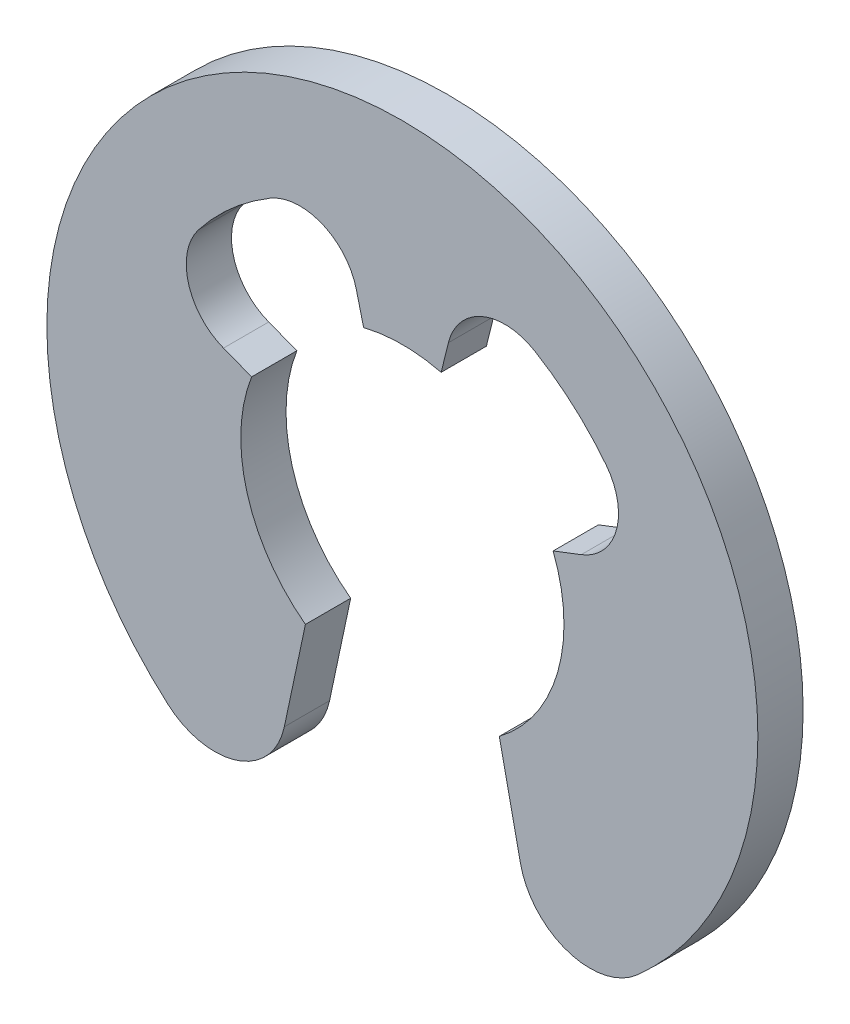
ISO-10303-21;
HEADER;
FILE_DESCRIPTION(('STEP AP214'),'2;1');
FILE_NAME('part.step','',(''),(''),'','','');
FILE_SCHEMA(('AUTOMOTIVE_DESIGN { 1 0 10303 214 1 1 1 1 }'));
ENDSEC;
DATA;
#1=APPLICATION_CONTEXT('core data for automotive mechanical design processes');
#2=APPLICATION_PROTOCOL_DEFINITION('international standard','automotive_design',2000,#1);
#3=PRODUCT_CONTEXT('',#1,'mechanical');
#4=PRODUCT('Part','Part','',(#3));
#5=PRODUCT_RELATED_PRODUCT_CATEGORY('part','',(#4));
#6=PRODUCT_DEFINITION_FORMATION('','',#4);
#7=PRODUCT_DEFINITION_CONTEXT('part definition',#1,'design');
#8=PRODUCT_DEFINITION('design','',#6,#7);
#9=PRODUCT_DEFINITION_SHAPE('','',#8);
#10=(LENGTH_UNIT() NAMED_UNIT(*) SI_UNIT(.MILLI.,.METRE.));
#11=(NAMED_UNIT(*) PLANE_ANGLE_UNIT() SI_UNIT($,.RADIAN.));
#12=(NAMED_UNIT(*) SI_UNIT($,.STERADIAN.) SOLID_ANGLE_UNIT());
#13=UNCERTAINTY_MEASURE_WITH_UNIT(LENGTH_MEASURE(1.E-05),#10,'distance_accuracy_value','');
#14=(GEOMETRIC_REPRESENTATION_CONTEXT(3) GLOBAL_UNCERTAINTY_ASSIGNED_CONTEXT((#13)) GLOBAL_UNIT_ASSIGNED_CONTEXT((#10,
#11,#12)) REPRESENTATION_CONTEXT('',''));
#15=CARTESIAN_POINT('',(0.,0.,0.));
#16=DIRECTION('',(0.,0.,1.));
#17=DIRECTION('',(1.,0.,0.));
#18=AXIS2_PLACEMENT_3D('',#15,#16,#17);
#19=CARTESIAN_POINT('',(0.,0.,0.7));
#20=DIRECTION('',(0.,0.,-1.));
#21=DIRECTION('',(-1.,0.,0.));
#22=AXIS2_PLACEMENT_3D('',#19,#20,#21);
#23=CYLINDRICAL_SURFACE('',#22,2.5);
#24=CARTESIAN_POINT('',(0.,0.,0.));
#25=DIRECTION('',(0.,0.,-1.));
#26=DIRECTION('',(1.,0.,0.));
#27=AXIS2_PLACEMENT_3D('',#24,#25,#26);
#28=CIRCLE('',#27,2.5);
#29=CARTESIAN_POINT('',(-1.5,-2.,0.));
#30=VERTEX_POINT('',#29);
#31=CARTESIAN_POINT('',(-2.33238075793812,0.9,0.));
#32=VERTEX_POINT('',#31);
#33=EDGE_CURVE('E189',#30,#32,#28,.T.);
#34=ORIENTED_EDGE('',*,*,#33,.T.);
#35=DIRECTION('',(0.,0.,-1.));
#36=VECTOR('',#35,1.);
#37=CARTESIAN_POINT('',(-2.33238075793812,0.9,0.7));
#38=LINE('',#37,#36);
#39=CARTESIAN_POINT('',(-2.33238075793812,0.9,0.7));
#40=VERTEX_POINT('',#39);
#41=EDGE_CURVE('E11',#40,#32,#38,.T.);
#42=ORIENTED_EDGE('',*,*,#41,.F.);
#43=CARTESIAN_POINT('',(0.,0.,0.7));
#44=DIRECTION('',(0.,0.,-1.));
#45=DIRECTION('',(1.,0.,0.));
#46=AXIS2_PLACEMENT_3D('',#43,#44,#45);
#47=CIRCLE('',#46,2.5);
#48=CARTESIAN_POINT('',(-1.5,-2.,0.7));
#49=VERTEX_POINT('',#48);
#50=EDGE_CURVE('E223',#49,#40,#47,.T.);
#51=ORIENTED_EDGE('',*,*,#50,.F.);
#52=DIRECTION('',(0.,0.,-1.));
#53=VECTOR('',#52,1.);
#54=CARTESIAN_POINT('',(-1.5,-2.,0.7));
#55=LINE('',#54,#53);
#56=EDGE_CURVE('E185',#49,#30,#55,.T.);
#57=ORIENTED_EDGE('',*,*,#56,.T.);
#58=EDGE_LOOP('',(#34,#42,#51,#57));
#59=FACE_BOUND('',#58,.T.);
#60=ADVANCED_FACE('F33',(#59),#23,.F.);
#61=CARTESIAN_POINT('',(-2.33238075793812,0.9,0.7));
#62=DIRECTION('',(-0.36,-0.932952303175248,0.));
#63=DIRECTION('',(0.932952303175248,-0.36,0.));
#64=AXIS2_PLACEMENT_3D('',#61,#62,#63);
#65=PLANE('',#64);
#66=DIRECTION('',(-0.932952303175248,0.36,0.));
#67=VECTOR('',#66,1.);
#68=CARTESIAN_POINT('',(-2.33238075793812,0.9,0.));
#69=LINE('',#68,#67);
#70=CARTESIAN_POINT('',(-2.76758378373628,1.06793258214178,0.));
#71=VERTEX_POINT('',#70);
#72=EDGE_CURVE('E192',#32,#71,#69,.T.);
#73=ORIENTED_EDGE('',*,*,#72,.T.);
#74=DIRECTION('',(0.,0.,-1.));
#75=VECTOR('',#74,1.);
#76=CARTESIAN_POINT('',(-2.76758378373628,1.06793258214178,0.7));
#77=LINE('',#76,#75);
#78=CARTESIAN_POINT('',(-2.76758378373628,1.06793258214178,0.7));
#79=VERTEX_POINT('',#78);
#80=EDGE_CURVE('E41',#79,#71,#77,.T.);
#81=ORIENTED_EDGE('',*,*,#80,.F.);
#82=DIRECTION('',(-0.932952303175248,0.36,0.));
#83=VECTOR('',#82,1.);
#84=CARTESIAN_POINT('',(-2.33238075793812,0.9,0.7));
#85=LINE('',#84,#83);
#86=EDGE_CURVE('E122',#40,#79,#85,.T.);
#87=ORIENTED_EDGE('',*,*,#86,.F.);
#88=ORIENTED_EDGE('',*,*,#41,.T.);
#89=EDGE_LOOP('',(#73,#81,#87,#88));
#90=FACE_BOUND('',#89,.T.);
#91=ADVANCED_FACE('F331',(#90),#65,.F.);
#92=CARTESIAN_POINT('',(-2.44358378373628,1.9075896549995,0.7));
#93=DIRECTION('',(0.,0.,-1.));
#94=DIRECTION('',(-1.,0.,0.));
#95=AXIS2_PLACEMENT_3D('',#92,#93,#94);
#96=CYLINDRICAL_SURFACE('',#95,0.9);
#97=CARTESIAN_POINT('',(-2.44358378373628,1.9075896549995,0.));
#98=DIRECTION('',(0.,0.,-1.));
#99=DIRECTION('',(1.,0.,0.));
#100=AXIS2_PLACEMENT_3D('',#97,#98,#99);
#101=CIRCLE('',#100,0.9);
#102=CARTESIAN_POINT('',(-3.15301133385326,2.46140600645097,0.));
#103=VERTEX_POINT('',#102);
#104=EDGE_CURVE('E194',#71,#103,#101,.T.);
#105=ORIENTED_EDGE('',*,*,#104,.T.);
#106=DIRECTION('',(0.,0.,-1.));
#107=VECTOR('',#106,1.);
#108=CARTESIAN_POINT('',(-3.15301133385326,2.46140600645097,0.7));
#109=LINE('',#108,#107);
#110=CARTESIAN_POINT('',(-3.15301133385326,2.46140600645097,0.7));
#111=VERTEX_POINT('',#110);
#112=EDGE_CURVE('E260',#111,#103,#109,.T.);
#113=ORIENTED_EDGE('',*,*,#112,.F.);
#114=CARTESIAN_POINT('',(-2.44358378373628,1.9075896549995,0.7));
#115=DIRECTION('',(0.,0.,-1.));
#116=DIRECTION('',(1.,0.,0.));
#117=AXIS2_PLACEMENT_3D('',#114,#115,#116);
#118=CIRCLE('',#117,0.9);
#119=EDGE_CURVE('E268',#79,#111,#118,.T.);
#120=ORIENTED_EDGE('',*,*,#119,.F.);
#121=ORIENTED_EDGE('',*,*,#80,.T.);
#122=EDGE_LOOP('',(#105,#113,#120,#121));
#123=FACE_BOUND('',#122,.T.);
#124=ADVANCED_FACE('F266',(#123),#96,.F.);
#125=CARTESIAN_POINT('',(0.,0.,0.7));
#126=DIRECTION('',(0.,0.,-1.));
#127=DIRECTION('',(-1.,0.,0.));
#128=AXIS2_PLACEMENT_3D('',#125,#126,#127);
#129=CYLINDRICAL_SURFACE('',#128,4.);
#130=CARTESIAN_POINT('',(0.,0.,0.));
#131=DIRECTION('',(0.,0.,-1.));
#132=DIRECTION('',(1.,0.,0.));
#133=AXIS2_PLACEMENT_3D('',#130,#131,#132);
#134=CIRCLE('',#133,4.);
#135=CARTESIAN_POINT('',(-2.04600084377551,3.43713260542416,0.));
#136=VERTEX_POINT('',#135);
#137=EDGE_CURVE('E196',#103,#136,#134,.T.);
#138=ORIENTED_EDGE('',*,*,#137,.T.);
#139=DIRECTION('',(0.,0.,-1.));
#140=VECTOR('',#139,1.);
#141=CARTESIAN_POINT('',(-2.04600084377551,3.43713260542416,0.7));
#142=LINE('',#141,#140);
#143=CARTESIAN_POINT('',(-2.04600084377551,3.43713260542416,0.7));
#144=VERTEX_POINT('',#143);
#145=EDGE_CURVE('E257',#144,#136,#142,.T.);
#146=ORIENTED_EDGE('',*,*,#145,.F.);
#147=CARTESIAN_POINT('',(0.,0.,0.7));
#148=DIRECTION('',(0.,0.,-1.));
#149=DIRECTION('',(1.,0.,0.));
#150=AXIS2_PLACEMENT_3D('',#147,#148,#149);
#151=CIRCLE('',#150,4.);
#152=EDGE_CURVE('E286',#111,#144,#151,.T.);
#153=ORIENTED_EDGE('',*,*,#152,.F.);
#154=ORIENTED_EDGE('',*,*,#112,.T.);
#155=EDGE_LOOP('',(#138,#146,#153,#154));
#156=FACE_BOUND('',#155,.T.);
#157=ADVANCED_FACE('F277',(#156),#129,.F.);
#158=CARTESIAN_POINT('',(-1.58565065392602,2.66377776920373,0.7));
#159=DIRECTION('',(0.,0.,-1.));
#160=DIRECTION('',(-1.,0.,0.));
#161=AXIS2_PLACEMENT_3D('',#158,#159,#160);
#162=CYLINDRICAL_SURFACE('',#161,0.9);
#163=CARTESIAN_POINT('',(-1.58565065392602,2.66377776920373,0.));
#164=DIRECTION('',(0.,0.,-1.));
#165=DIRECTION('',(1.,0.,0.));
#166=AXIS2_PLACEMENT_3D('',#163,#164,#165);
#167=CIRCLE('',#166,0.9);
#168=CARTESIAN_POINT('',(-0.711955054761184,2.87977776920373,0.));
#169=VERTEX_POINT('',#168);
#170=EDGE_CURVE('E198',#136,#169,#167,.T.);
#171=ORIENTED_EDGE('',*,*,#170,.T.);
#172=DIRECTION('',(0.,0.,-1.));
#173=VECTOR('',#172,1.);
#174=CARTESIAN_POINT('',(-0.711955054761184,2.87977776920373,0.7));
#175=LINE('',#174,#173);
#176=CARTESIAN_POINT('',(-0.711955054761184,2.87977776920373,0.7));
#177=VERTEX_POINT('',#176);
#178=EDGE_CURVE('E254',#177,#169,#175,.T.);
#179=ORIENTED_EDGE('',*,*,#178,.F.);
#180=CARTESIAN_POINT('',(-1.58565065392602,2.66377776920373,0.7));
#181=DIRECTION('',(0.,0.,-1.));
#182=DIRECTION('',(1.,0.,0.));
#183=AXIS2_PLACEMENT_3D('',#180,#181,#182);
#184=CIRCLE('',#183,0.9);
#185=EDGE_CURVE('E283',#144,#177,#184,.T.);
#186=ORIENTED_EDGE('',*,*,#185,.F.);
#187=ORIENTED_EDGE('',*,*,#145,.T.);
#188=EDGE_LOOP('',(#171,#179,#186,#187));
#189=FACE_BOUND('',#188,.T.);
#190=ADVANCED_FACE('F281',(#189),#162,.F.);
#191=CARTESIAN_POINT('',(-0.711955054761184,2.87977776920373,0.7));
#192=DIRECTION('',(0.970772887960928,0.240000000000001,0.));
#193=DIRECTION('',(-0.240000000000001,0.970772887960928,0.));
#194=AXIS2_PLACEMENT_3D('',#191,#192,#193);
#195=PLANE('',#194);
#196=DIRECTION('',(0.240000000000001,-0.970772887960928,0.));
#197=VECTOR('',#196,1.);
#198=CARTESIAN_POINT('',(-0.711955054761184,2.87977776920373,0.));
#199=LINE('',#198,#197);
#200=CARTESIAN_POINT('',(-0.6,2.42693221990232,0.));
#201=VERTEX_POINT('',#200);
#202=EDGE_CURVE('E200',#169,#201,#199,.T.);
#203=ORIENTED_EDGE('',*,*,#202,.T.);
#204=DIRECTION('',(0.,0.,-1.));
#205=VECTOR('',#204,1.);
#206=CARTESIAN_POINT('',(-0.6,2.42693221990232,0.7));
#207=LINE('',#206,#205);
#208=CARTESIAN_POINT('',(-0.6,2.42693221990232,0.7));
#209=VERTEX_POINT('',#208);
#210=EDGE_CURVE('E251',#209,#201,#207,.T.);
#211=ORIENTED_EDGE('',*,*,#210,.F.);
#212=DIRECTION('',(0.240000000000001,-0.970772887960928,0.));
#213=VECTOR('',#212,1.);
#214=CARTESIAN_POINT('',(-0.711955054761184,2.87977776920373,0.7));
#215=LINE('',#214,#213);
#216=EDGE_CURVE('E285',#177,#209,#215,.T.);
#217=ORIENTED_EDGE('',*,*,#216,.F.);
#218=ORIENTED_EDGE('',*,*,#178,.T.);
#219=EDGE_LOOP('',(#203,#211,#217,#218));
#220=FACE_BOUND('',#219,.T.);
#221=ADVANCED_FACE('F344',(#220),#195,.F.);
#222=CARTESIAN_POINT('',(0.,0.,0.7));
#223=DIRECTION('',(0.,0.,-1.));
#224=DIRECTION('',(-1.,0.,0.));
#225=AXIS2_PLACEMENT_3D('',#222,#223,#224);
#226=CYLINDRICAL_SURFACE('',#225,2.5);
#227=CARTESIAN_POINT('',(0.,0.,0.));
#228=DIRECTION('',(0.,0.,-1.));
#229=DIRECTION('',(1.,0.,0.));
#230=AXIS2_PLACEMENT_3D('',#227,#228,#229);
#231=CIRCLE('',#230,2.5);
#232=CARTESIAN_POINT('',(0.6,2.42693221990232,0.));
#233=VERTEX_POINT('',#232);
#234=EDGE_CURVE('E202',#201,#233,#231,.T.);
#235=ORIENTED_EDGE('',*,*,#234,.T.);
#236=DIRECTION('',(0.,0.,-1.));
#237=VECTOR('',#236,1.);
#238=CARTESIAN_POINT('',(0.6,2.42693221990232,0.7));
#239=LINE('',#238,#237);
#240=CARTESIAN_POINT('',(0.6,2.42693221990232,0.7));
#241=VERTEX_POINT('',#240);
#242=EDGE_CURVE('E248',#241,#233,#239,.T.);
#243=ORIENTED_EDGE('',*,*,#242,.F.);
#244=CARTESIAN_POINT('',(0.,0.,0.7));
#245=DIRECTION('',(0.,0.,-1.));
#246=DIRECTION('',(1.,0.,0.));
#247=AXIS2_PLACEMENT_3D('',#244,#245,#246);
#248=CIRCLE('',#247,2.5);
#249=EDGE_CURVE('E288',#209,#241,#248,.T.);
#250=ORIENTED_EDGE('',*,*,#249,.F.);
#251=ORIENTED_EDGE('',*,*,#210,.T.);
#252=EDGE_LOOP('',(#235,#243,#250,#251));
#253=FACE_BOUND('',#252,.T.);
#254=ADVANCED_FACE('F347',(#253),#226,.F.);
#255=CARTESIAN_POINT('',(0.6,2.42693221990232,0.7));
#256=DIRECTION('',(-0.970772887960928,0.239999999999999,0.));
#257=DIRECTION('',(-0.239999999999999,-0.970772887960928,0.));
#258=AXIS2_PLACEMENT_3D('',#255,#256,#257);
#259=PLANE('',#258);
#260=DIRECTION('',(0.239999999999999,0.970772887960928,0.));
#261=VECTOR('',#260,1.);
#262=CARTESIAN_POINT('',(0.6,2.42693221990232,0.));
#263=LINE('',#262,#261);
#264=CARTESIAN_POINT('',(0.711955054761183,2.87977776920373,0.));
#265=VERTEX_POINT('',#264);
#266=EDGE_CURVE('E204',#233,#265,#263,.T.);
#267=ORIENTED_EDGE('',*,*,#266,.T.);
#268=DIRECTION('',(0.,0.,-1.));
#269=VECTOR('',#268,1.);
#270=CARTESIAN_POINT('',(0.711955054761183,2.87977776920373,0.7));
#271=LINE('',#270,#269);
#272=CARTESIAN_POINT('',(0.711955054761183,2.87977776920373,0.7));
#273=VERTEX_POINT('',#272);
#274=EDGE_CURVE('E245',#273,#265,#271,.T.);
#275=ORIENTED_EDGE('',*,*,#274,.F.);
#276=DIRECTION('',(0.239999999999999,0.970772887960928,0.));
#277=VECTOR('',#276,1.);
#278=CARTESIAN_POINT('',(0.6,2.42693221990232,0.7));
#279=LINE('',#278,#277);
#280=EDGE_CURVE('E294',#241,#273,#279,.T.);
#281=ORIENTED_EDGE('',*,*,#280,.F.);
#282=ORIENTED_EDGE('',*,*,#242,.T.);
#283=EDGE_LOOP('',(#267,#275,#281,#282));
#284=FACE_BOUND('',#283,.T.);
#285=ADVANCED_FACE('F351',(#284),#259,.F.);
#286=CARTESIAN_POINT('',(1.58565065392602,2.66377776920373,0.7));
#287=DIRECTION('',(0.,0.,-1.));
#288=DIRECTION('',(-1.,0.,0.));
#289=AXIS2_PLACEMENT_3D('',#286,#287,#288);
#290=CYLINDRICAL_SURFACE('',#289,0.9);
#291=CARTESIAN_POINT('',(1.58565065392602,2.66377776920373,0.));
#292=DIRECTION('',(0.,0.,-1.));
#293=DIRECTION('',(1.,0.,0.));
#294=AXIS2_PLACEMENT_3D('',#291,#292,#293);
#295=CIRCLE('',#294,0.9);
#296=CARTESIAN_POINT('',(2.04600084377551,3.43713260542417,0.));
#297=VERTEX_POINT('',#296);
#298=EDGE_CURVE('E206',#265,#297,#295,.T.);
#299=ORIENTED_EDGE('',*,*,#298,.T.);
#300=DIRECTION('',(0.,0.,-1.));
#301=VECTOR('',#300,1.);
#302=CARTESIAN_POINT('',(2.04600084377551,3.43713260542417,0.7));
#303=LINE('',#302,#301);
#304=CARTESIAN_POINT('',(2.04600084377551,3.43713260542417,0.7));
#305=VERTEX_POINT('',#304);
#306=EDGE_CURVE('E242',#305,#297,#303,.T.);
#307=ORIENTED_EDGE('',*,*,#306,.F.);
#308=CARTESIAN_POINT('',(1.58565065392602,2.66377776920373,0.7));
#309=DIRECTION('',(0.,0.,-1.));
#310=DIRECTION('',(1.,0.,0.));
#311=AXIS2_PLACEMENT_3D('',#308,#309,#310);
#312=CIRCLE('',#311,0.9);
#313=EDGE_CURVE('E296',#273,#305,#312,.T.);
#314=ORIENTED_EDGE('',*,*,#313,.F.);
#315=ORIENTED_EDGE('',*,*,#274,.T.);
#316=EDGE_LOOP('',(#299,#307,#314,#315));
#317=FACE_BOUND('',#316,.T.);
#318=ADVANCED_FACE('F355',(#317),#290,.F.);
#319=CARTESIAN_POINT('',(0.,0.,0.7));
#320=DIRECTION('',(0.,0.,-1.));
#321=DIRECTION('',(-1.,0.,0.));
#322=AXIS2_PLACEMENT_3D('',#319,#320,#321);
#323=CYLINDRICAL_SURFACE('',#322,4.);
#324=CARTESIAN_POINT('',(0.,0.,0.));
#325=DIRECTION('',(0.,0.,-1.));
#326=DIRECTION('',(1.,0.,0.));
#327=AXIS2_PLACEMENT_3D('',#324,#325,#326);
#328=CIRCLE('',#327,4.);
#329=CARTESIAN_POINT('',(3.15301133385326,2.46140600645097,0.));
#330=VERTEX_POINT('',#329);
#331=EDGE_CURVE('E208',#297,#330,#328,.T.);
#332=ORIENTED_EDGE('',*,*,#331,.T.);
#333=DIRECTION('',(0.,0.,-1.));
#334=VECTOR('',#333,1.);
#335=CARTESIAN_POINT('',(3.15301133385326,2.46140600645097,0.7));
#336=LINE('',#335,#334);
#337=CARTESIAN_POINT('',(3.15301133385326,2.46140600645097,0.7));
#338=VERTEX_POINT('',#337);
#339=EDGE_CURVE('E239',#338,#330,#336,.T.);
#340=ORIENTED_EDGE('',*,*,#339,.F.);
#341=CARTESIAN_POINT('',(0.,0.,0.7));
#342=DIRECTION('',(0.,0.,-1.));
#343=DIRECTION('',(1.,0.,0.));
#344=AXIS2_PLACEMENT_3D('',#341,#342,#343);
#345=CIRCLE('',#344,4.);
#346=EDGE_CURVE('E298',#305,#338,#345,.T.);
#347=ORIENTED_EDGE('',*,*,#346,.F.);
#348=ORIENTED_EDGE('',*,*,#306,.T.);
#349=EDGE_LOOP('',(#332,#340,#347,#348));
#350=FACE_BOUND('',#349,.T.);
#351=ADVANCED_FACE('F359',(#350),#323,.F.);
#352=CARTESIAN_POINT('',(2.44358378373628,1.9075896549995,0.7));
#353=DIRECTION('',(0.,0.,-1.));
#354=DIRECTION('',(-1.,0.,0.));
#355=AXIS2_PLACEMENT_3D('',#352,#353,#354);
#356=CYLINDRICAL_SURFACE('',#355,0.9);
#357=CARTESIAN_POINT('',(2.44358378373628,1.9075896549995,0.));
#358=DIRECTION('',(0.,0.,-1.));
#359=DIRECTION('',(1.,0.,0.));
#360=AXIS2_PLACEMENT_3D('',#357,#358,#359);
#361=CIRCLE('',#360,0.9);
#362=CARTESIAN_POINT('',(2.76758378373628,1.06793258214178,0.));
#363=VERTEX_POINT('',#362);
#364=EDGE_CURVE('E210',#330,#363,#361,.T.);
#365=ORIENTED_EDGE('',*,*,#364,.T.);
#366=DIRECTION('',(0.,0.,-1.));
#367=VECTOR('',#366,1.);
#368=CARTESIAN_POINT('',(2.76758378373628,1.06793258214178,0.7));
#369=LINE('',#368,#367);
#370=CARTESIAN_POINT('',(2.76758378373628,1.06793258214178,0.7));
#371=VERTEX_POINT('',#370);
#372=EDGE_CURVE('E236',#371,#363,#369,.T.);
#373=ORIENTED_EDGE('',*,*,#372,.F.);
#374=CARTESIAN_POINT('',(2.44358378373628,1.9075896549995,0.7));
#375=DIRECTION('',(0.,0.,-1.));
#376=DIRECTION('',(1.,0.,0.));
#377=AXIS2_PLACEMENT_3D('',#374,#375,#376);
#378=CIRCLE('',#377,0.9);
#379=EDGE_CURVE('E300',#338,#371,#378,.T.);
#380=ORIENTED_EDGE('',*,*,#379,.F.);
#381=ORIENTED_EDGE('',*,*,#339,.T.);
#382=EDGE_LOOP('',(#365,#373,#380,#381));
#383=FACE_BOUND('',#382,.T.);
#384=ADVANCED_FACE('F363',(#383),#356,.F.);
#385=CARTESIAN_POINT('',(2.76758378373628,1.06793258214178,0.7));
#386=DIRECTION('',(0.36,-0.932952303175248,0.));
#387=DIRECTION('',(0.932952303175248,0.36,0.));
#388=AXIS2_PLACEMENT_3D('',#385,#386,#387);
#389=PLANE('',#388);
#390=DIRECTION('',(-0.932952303175248,-0.36,0.));
#391=VECTOR('',#390,1.);
#392=CARTESIAN_POINT('',(2.76758378373628,1.06793258214178,0.));
#393=LINE('',#392,#391);
#394=CARTESIAN_POINT('',(2.33238075793812,0.899999999999999,0.));
#395=VERTEX_POINT('',#394);
#396=EDGE_CURVE('E212',#363,#395,#393,.T.);
#397=ORIENTED_EDGE('',*,*,#396,.T.);
#398=DIRECTION('',(0.,0.,-1.));
#399=VECTOR('',#398,1.);
#400=CARTESIAN_POINT('',(2.33238075793812,0.899999999999999,0.7));
#401=LINE('',#400,#399);
#402=CARTESIAN_POINT('',(2.33238075793812,0.899999999999999,0.7));
#403=VERTEX_POINT('',#402);
#404=EDGE_CURVE('E233',#403,#395,#401,.T.);
#405=ORIENTED_EDGE('',*,*,#404,.F.);
#406=DIRECTION('',(-0.932952303175248,-0.36,0.));
#407=VECTOR('',#406,1.);
#408=CARTESIAN_POINT('',(2.76758378373628,1.06793258214178,0.7));
#409=LINE('',#408,#407);
#410=EDGE_CURVE('E302',#371,#403,#409,.T.);
#411=ORIENTED_EDGE('',*,*,#410,.F.);
#412=ORIENTED_EDGE('',*,*,#372,.T.);
#413=EDGE_LOOP('',(#397,#405,#411,#412));
#414=FACE_BOUND('',#413,.T.);
#415=ADVANCED_FACE('F367',(#414),#389,.F.);
#416=CARTESIAN_POINT('',(0.,0.,0.7));
#417=DIRECTION('',(0.,0.,-1.));
#418=DIRECTION('',(-1.,0.,0.));
#419=AXIS2_PLACEMENT_3D('',#416,#417,#418);
#420=CYLINDRICAL_SURFACE('',#419,2.5);
#421=CARTESIAN_POINT('',(0.,0.,0.));
#422=DIRECTION('',(0.,0.,-1.));
#423=DIRECTION('',(1.,0.,0.));
#424=AXIS2_PLACEMENT_3D('',#421,#422,#423);
#425=CIRCLE('',#424,2.5);
#426=CARTESIAN_POINT('',(1.5,-2.,0.));
#427=VERTEX_POINT('',#426);
#428=EDGE_CURVE('E214',#395,#427,#425,.T.);
#429=ORIENTED_EDGE('',*,*,#428,.T.);
#430=DIRECTION('',(0.,0.,-1.));
#431=VECTOR('',#430,1.);
#432=CARTESIAN_POINT('',(1.5,-2.,0.7));
#433=LINE('',#432,#431);
#434=CARTESIAN_POINT('',(1.5,-2.,0.7));
#435=VERTEX_POINT('',#434);
#436=EDGE_CURVE('E230',#435,#427,#433,.T.);
#437=ORIENTED_EDGE('',*,*,#436,.F.);
#438=CARTESIAN_POINT('',(0.,0.,0.7));
#439=DIRECTION('',(0.,0.,-1.));
#440=DIRECTION('',(1.,0.,0.));
#441=AXIS2_PLACEMENT_3D('',#438,#439,#440);
#442=CIRCLE('',#441,2.5);
#443=EDGE_CURVE('E304',#403,#435,#442,.T.);
#444=ORIENTED_EDGE('',*,*,#443,.F.);
#445=ORIENTED_EDGE('',*,*,#404,.T.);
#446=EDGE_LOOP('',(#429,#437,#444,#445));
#447=FACE_BOUND('',#446,.T.);
#448=ADVANCED_FACE('F371',(#447),#420,.F.);
#449=CARTESIAN_POINT('',(1.5,-2.,0.7));
#450=DIRECTION('',(0.978147600733806,0.20791169081776,0.));
#451=DIRECTION('',(-0.20791169081776,0.978147600733806,0.));
#452=AXIS2_PLACEMENT_3D('',#449,#450,#451);
#453=PLANE('',#452);
#454=DIRECTION('',(0.20791169081776,-0.978147600733805,0.));
#455=VECTOR('',#454,1.);
#456=CARTESIAN_POINT('',(1.5,-2.,0.));
#457=LINE('',#456,#455);
#458=CARTESIAN_POINT('',(1.82642117476295,-3.53569088716111,0.));
#459=VERTEX_POINT('',#458);
#460=EDGE_CURVE('E216',#427,#459,#457,.T.);
#461=ORIENTED_EDGE('',*,*,#460,.T.);
#462=DIRECTION('',(0.,0.,-1.));
#463=VECTOR('',#462,1.);
#464=CARTESIAN_POINT('',(1.82642117476295,-3.53569088716111,0.7));
#465=LINE('',#464,#463);
#466=CARTESIAN_POINT('',(1.82642117476295,-3.53569088716111,0.7));
#467=VERTEX_POINT('',#466);
#468=EDGE_CURVE('E227',#467,#459,#465,.T.);
#469=ORIENTED_EDGE('',*,*,#468,.F.);
#470=DIRECTION('',(0.20791169081776,-0.978147600733805,0.));
#471=VECTOR('',#470,1.);
#472=CARTESIAN_POINT('',(1.5,-2.,0.7));
#473=LINE('',#472,#471);
#474=EDGE_CURVE('E306',#435,#467,#473,.T.);
#475=ORIENTED_EDGE('',*,*,#474,.F.);
#476=ORIENTED_EDGE('',*,*,#436,.T.);
#477=EDGE_LOOP('',(#461,#469,#475,#476));
#478=FACE_BOUND('',#477,.T.);
#479=ADVANCED_FACE('F312',(#478),#453,.F.);
#480=CARTESIAN_POINT('',(2.90238353557014,-3.30698802726157,0.7));
#481=DIRECTION('',(0.,0.,-1.));
#482=DIRECTION('',(-1.,0.,0.));
#483=AXIS2_PLACEMENT_3D('',#480,#481,#482);
#484=CYLINDRICAL_SURFACE('',#483,1.1);
#485=CARTESIAN_POINT('',(2.90238353557014,-3.30698802726157,0.));
#486=DIRECTION('',(0.,0.,1.));
#487=DIRECTION('',(-1.,0.,0.));
#488=AXIS2_PLACEMENT_3D('',#485,#486,#487);
#489=CIRCLE('',#488,1.1);
#490=CARTESIAN_POINT('',(3.62797941946267,-4.13373503407696,0.));
#491=VERTEX_POINT('',#490);
#492=EDGE_CURVE('E218',#459,#491,#489,.T.);
#493=ORIENTED_EDGE('',*,*,#492,.T.);
#494=DIRECTION('',(0.,0.,-1.));
#495=VECTOR('',#494,1.);
#496=CARTESIAN_POINT('',(3.62797941946267,-4.13373503407696,0.7));
#497=LINE('',#496,#495);
#498=CARTESIAN_POINT('',(3.62797941946267,-4.13373503407696,0.7));
#499=VERTEX_POINT('',#498);
#500=EDGE_CURVE('E180',#499,#491,#497,.T.);
#501=ORIENTED_EDGE('',*,*,#500,.F.);
#502=CARTESIAN_POINT('',(2.90238353557014,-3.30698802726157,0.7));
#503=DIRECTION('',(0.,0.,1.));
#504=DIRECTION('',(-1.,0.,0.));
#505=AXIS2_PLACEMENT_3D('',#502,#503,#504);
#506=CIRCLE('',#505,1.1);
#507=EDGE_CURVE('E171',#467,#499,#506,.T.);
#508=ORIENTED_EDGE('',*,*,#507,.F.);
#509=ORIENTED_EDGE('',*,*,#468,.T.);
#510=EDGE_LOOP('',(#493,#501,#508,#509));
#511=FACE_BOUND('',#510,.T.);
#512=ADVANCED_FACE('F316',(#511),#484,.T.);
#513=CARTESIAN_POINT('',(0.,0.,0.7));
#514=DIRECTION('',(0.,0.,-1.));
#515=DIRECTION('',(-1.,0.,0.));
#516=AXIS2_PLACEMENT_3D('',#513,#514,#515);
#517=CYLINDRICAL_SURFACE('',#516,5.5);
#518=CARTESIAN_POINT('',(0.,0.,0.));
#519=DIRECTION('',(0.,0.,1.));
#520=DIRECTION('',(1.,0.,0.));
#521=AXIS2_PLACEMENT_3D('',#518,#519,#520);
#522=CIRCLE('',#521,5.5);
#523=CARTESIAN_POINT('',(-3.62797941946267,-4.13373503407697,0.));
#524=VERTEX_POINT('',#523);
#525=EDGE_CURVE('E179',#491,#524,#522,.T.);
#526=ORIENTED_EDGE('',*,*,#525,.T.);
#527=DIRECTION('',(0.,0.,-1.));
#528=VECTOR('',#527,1.);
#529=CARTESIAN_POINT('',(-3.62797941946267,-4.13373503407697,0.7));
#530=LINE('',#529,#528);
#531=CARTESIAN_POINT('',(-3.62797941946267,-4.13373503407697,0.7));
#532=VERTEX_POINT('',#531);
#533=EDGE_CURVE('E176',#532,#524,#530,.T.);
#534=ORIENTED_EDGE('',*,*,#533,.F.);
#535=CARTESIAN_POINT('',(0.,0.,0.7));
#536=DIRECTION('',(0.,0.,1.));
#537=DIRECTION('',(1.,0.,0.));
#538=AXIS2_PLACEMENT_3D('',#535,#536,#537);
#539=CIRCLE('',#538,5.5);
#540=EDGE_CURVE('E165',#499,#532,#539,.T.);
#541=ORIENTED_EDGE('',*,*,#540,.F.);
#542=ORIENTED_EDGE('',*,*,#500,.T.);
#543=EDGE_LOOP('',(#526,#534,#541,#542));
#544=FACE_BOUND('',#543,.T.);
#545=ADVANCED_FACE('F177',(#544),#517,.T.);
#546=CARTESIAN_POINT('',(-2.90238353557014,-3.30698802726157,0.7));
#547=DIRECTION('',(0.,0.,-1.));
#548=DIRECTION('',(-1.,0.,0.));
#549=AXIS2_PLACEMENT_3D('',#546,#547,#548);
#550=CYLINDRICAL_SURFACE('',#549,1.1);
#551=CARTESIAN_POINT('',(-2.90238353557014,-3.30698802726157,0.));
#552=DIRECTION('',(0.,0.,1.));
#553=DIRECTION('',(1.,0.,0.));
#554=AXIS2_PLACEMENT_3D('',#551,#552,#553);
#555=CIRCLE('',#554,1.1);
#556=CARTESIAN_POINT('',(-1.82642117476295,-3.53569088716111,0.));
#557=VERTEX_POINT('',#556);
#558=EDGE_CURVE('E108',#524,#557,#555,.T.);
#559=ORIENTED_EDGE('',*,*,#558,.T.);
#560=DIRECTION('',(0.,0.,-1.));
#561=VECTOR('',#560,1.);
#562=CARTESIAN_POINT('',(-1.82642117476295,-3.53569088716111,0.7));
#563=LINE('',#562,#561);
#564=CARTESIAN_POINT('',(-1.82642117476295,-3.53569088716111,0.7));
#565=VERTEX_POINT('',#564);
#566=EDGE_CURVE('E181',#565,#557,#563,.T.);
#567=ORIENTED_EDGE('',*,*,#566,.F.);
#568=CARTESIAN_POINT('',(-2.90238353557014,-3.30698802726157,0.7));
#569=DIRECTION('',(0.,0.,1.));
#570=DIRECTION('',(1.,0.,0.));
#571=AXIS2_PLACEMENT_3D('',#568,#569,#570);
#572=CIRCLE('',#571,1.1);
#573=EDGE_CURVE('E169',#532,#565,#572,.T.);
#574=ORIENTED_EDGE('',*,*,#573,.F.);
#575=ORIENTED_EDGE('',*,*,#533,.T.);
#576=EDGE_LOOP('',(#559,#567,#574,#575));
#577=FACE_BOUND('',#576,.T.);
#578=ADVANCED_FACE('F183',(#577),#550,.T.);
#579=CARTESIAN_POINT('',(-1.5,-2.,0.7));
#580=DIRECTION('',(-0.978147600733806,0.207911690817759,0.));
#581=DIRECTION('',(-0.207911690817759,-0.978147600733806,0.));
#582=AXIS2_PLACEMENT_3D('',#579,#580,#581);
#583=PLANE('',#582);
#584=DIRECTION('',(0.207911690817759,0.978147600733806,0.));
#585=VECTOR('',#584,1.);
#586=CARTESIAN_POINT('',(-1.5,-2.,0.));
#587=LINE('',#586,#585);
#588=EDGE_CURVE('E114',#557,#30,#587,.T.);
#589=ORIENTED_EDGE('',*,*,#588,.T.);
#590=ORIENTED_EDGE('',*,*,#56,.F.);
#591=DIRECTION('',(0.207911690817759,0.978147600733806,0.));
#592=VECTOR('',#591,1.);
#593=CARTESIAN_POINT('',(-1.5,-2.,0.7));
#594=LINE('',#593,#592);
#595=EDGE_CURVE('E49',#565,#49,#594,.T.);
#596=ORIENTED_EDGE('',*,*,#595,.F.);
#597=ORIENTED_EDGE('',*,*,#566,.T.);
#598=EDGE_LOOP('',(#589,#590,#596,#597));
#599=FACE_BOUND('',#598,.T.);
#600=ADVANCED_FACE('F320',(#599),#583,.F.);
#601=CARTESIAN_POINT('',(0.,0.,0.7));
#602=DIRECTION('',(0.,0.,1.));
#603=DIRECTION('',(1.,0.,0.));
#604=AXIS2_PLACEMENT_3D('',#601,#602,#603);
#605=PLANE('',#604);
#606=ORIENTED_EDGE('',*,*,#50,.T.);
#607=ORIENTED_EDGE('',*,*,#86,.T.);
#608=ORIENTED_EDGE('',*,*,#119,.T.);
#609=ORIENTED_EDGE('',*,*,#152,.T.);
#610=ORIENTED_EDGE('',*,*,#185,.T.);
#611=ORIENTED_EDGE('',*,*,#216,.T.);
#612=ORIENTED_EDGE('',*,*,#249,.T.);
#613=ORIENTED_EDGE('',*,*,#280,.T.);
#614=ORIENTED_EDGE('',*,*,#313,.T.);
#615=ORIENTED_EDGE('',*,*,#346,.T.);
#616=ORIENTED_EDGE('',*,*,#379,.T.);
#617=ORIENTED_EDGE('',*,*,#410,.T.);
#618=ORIENTED_EDGE('',*,*,#443,.T.);
#619=ORIENTED_EDGE('',*,*,#474,.T.);
#620=ORIENTED_EDGE('',*,*,#507,.T.);
#621=ORIENTED_EDGE('',*,*,#540,.T.);
#622=ORIENTED_EDGE('',*,*,#573,.T.);
#623=ORIENTED_EDGE('',*,*,#595,.T.);
#624=EDGE_LOOP('',(#606,#607,#608,#609,#610,#611,#612,#613,#614,#615,#616,#617,#618,#619,#620,
#621,#622,#623));
#625=FACE_BOUND('',#624,.T.);
#626=ADVANCED_FACE('F167',(#625),#605,.T.);
#627=CARTESIAN_POINT('',(0.,0.,0.));
#628=DIRECTION('',(0.,0.,1.));
#629=DIRECTION('',(1.,0.,0.));
#630=AXIS2_PLACEMENT_3D('',#627,#628,#629);
#631=PLANE('',#630);
#632=ORIENTED_EDGE('',*,*,#33,.F.);
#633=ORIENTED_EDGE('',*,*,#588,.F.);
#634=ORIENTED_EDGE('',*,*,#558,.F.);
#635=ORIENTED_EDGE('',*,*,#525,.F.);
#636=ORIENTED_EDGE('',*,*,#492,.F.);
#637=ORIENTED_EDGE('',*,*,#460,.F.);
#638=ORIENTED_EDGE('',*,*,#428,.F.);
#639=ORIENTED_EDGE('',*,*,#396,.F.);
#640=ORIENTED_EDGE('',*,*,#364,.F.);
#641=ORIENTED_EDGE('',*,*,#331,.F.);
#642=ORIENTED_EDGE('',*,*,#298,.F.);
#643=ORIENTED_EDGE('',*,*,#266,.F.);
#644=ORIENTED_EDGE('',*,*,#234,.F.);
#645=ORIENTED_EDGE('',*,*,#202,.F.);
#646=ORIENTED_EDGE('',*,*,#170,.F.);
#647=ORIENTED_EDGE('',*,*,#137,.F.);
#648=ORIENTED_EDGE('',*,*,#104,.F.);
#649=ORIENTED_EDGE('',*,*,#72,.F.);
#650=EDGE_LOOP('',(#632,#633,#634,#635,#636,#637,#638,#639,#640,#641,#642,#643,#644,#645,#646,
#647,#648,#649));
#651=FACE_BOUND('',#650,.T.);
#652=ADVANCED_FACE('F272',(#651),#631,.F.);
#653=CLOSED_SHELL('',(#60,#91,#124,#157,#190,#221,#254,#285,#318,#351,#384,#415,#448,#479,#512,
#545,#578,#600,#626,#652));
#654=MANIFOLD_SOLID_BREP('B2',#653);
#655=ADVANCED_BREP_SHAPE_REPRESENTATION('',(#18,#654),#14);
#656=SHAPE_DEFINITION_REPRESENTATION(#9,#655);
ENDSEC;
END-ISO-10303-21;
